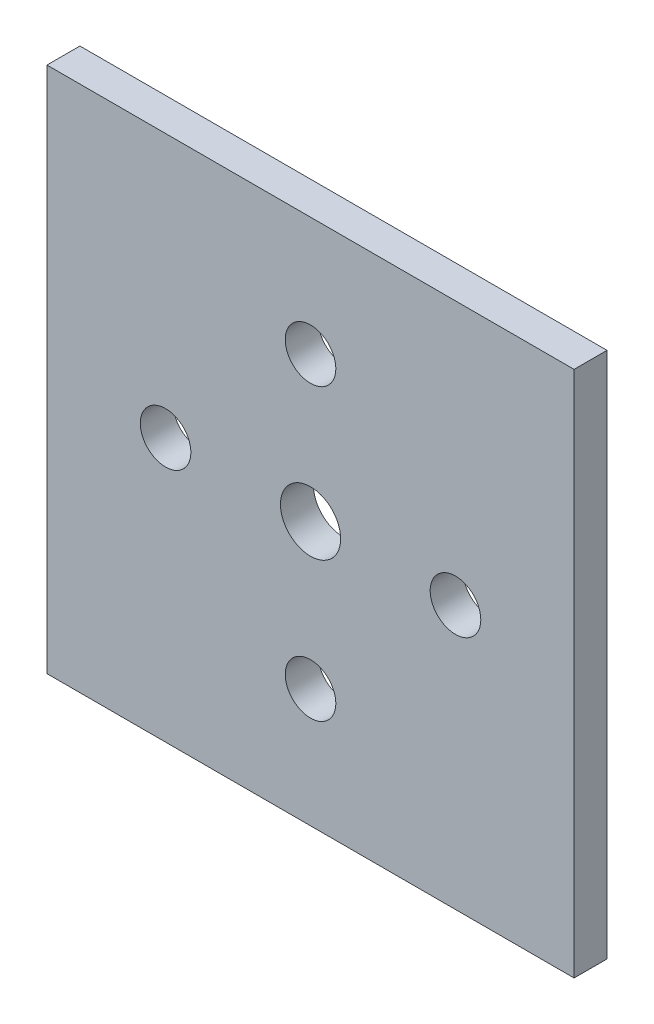
ISO-10303-21;
HEADER;
FILE_DESCRIPTION(('STEP AP214'),'2;1');
FILE_NAME('part.step','',(''),(''),'','','');
FILE_SCHEMA(('AUTOMOTIVE_DESIGN { 1 0 10303 214 1 1 1 1 }'));
ENDSEC;
DATA;
#1=APPLICATION_CONTEXT('core data for automotive mechanical design processes');
#2=APPLICATION_PROTOCOL_DEFINITION('international standard','automotive_design',2000,#1);
#3=PRODUCT_CONTEXT('',#1,'mechanical');
#4=PRODUCT('Part','Part','',(#3));
#5=PRODUCT_RELATED_PRODUCT_CATEGORY('part','',(#4));
#6=PRODUCT_DEFINITION_FORMATION('','',#4);
#7=PRODUCT_DEFINITION_CONTEXT('part definition',#1,'design');
#8=PRODUCT_DEFINITION('design','',#6,#7);
#9=PRODUCT_DEFINITION_SHAPE('','',#8);
#10=(LENGTH_UNIT() NAMED_UNIT(*) SI_UNIT(.MILLI.,.METRE.));
#11=(NAMED_UNIT(*) PLANE_ANGLE_UNIT() SI_UNIT($,.RADIAN.));
#12=(NAMED_UNIT(*) SI_UNIT($,.STERADIAN.) SOLID_ANGLE_UNIT());
#13=UNCERTAINTY_MEASURE_WITH_UNIT(LENGTH_MEASURE(1.E-05),#10,'distance_accuracy_value','');
#14=(GEOMETRIC_REPRESENTATION_CONTEXT(3) GLOBAL_UNCERTAINTY_ASSIGNED_CONTEXT((#13)) GLOBAL_UNIT_ASSIGNED_CONTEXT((#10,
#11,#12)) REPRESENTATION_CONTEXT('',''));
#15=CARTESIAN_POINT('',(0.,0.,0.));
#16=DIRECTION('',(0.,0.,1.));
#17=DIRECTION('',(1.,0.,0.));
#18=AXIS2_PLACEMENT_3D('',#15,#16,#17);
#19=CARTESIAN_POINT('',(0.,0.,-1.5875));
#20=DIRECTION('',(-1.,0.,0.));
#21=DIRECTION('',(0.,0.,1.));
#22=AXIS2_PLACEMENT_3D('',#19,#20,#21);
#23=PLANE('',#22);
#24=DIRECTION('',(0.,-1.,0.));
#25=VECTOR('',#24,1.);
#26=CARTESIAN_POINT('',(0.,0.,0.));
#27=LINE('',#26,#25);
#28=CARTESIAN_POINT('',(0.,25.4,0.));
#29=VERTEX_POINT('',#28);
#30=CARTESIAN_POINT('',(0.,0.,0.));
#31=VERTEX_POINT('',#30);
#32=EDGE_CURVE('E101',#29,#31,#27,.T.);
#33=ORIENTED_EDGE('',*,*,#32,.F.);
#34=DIRECTION('',(0.,0.,1.));
#35=VECTOR('',#34,1.);
#36=CARTESIAN_POINT('',(0.,25.4,-1.5875));
#37=LINE('',#36,#35);
#38=CARTESIAN_POINT('',(0.,25.4,-1.5875));
#39=VERTEX_POINT('',#38);
#40=EDGE_CURVE('E11',#39,#29,#37,.T.);
#41=ORIENTED_EDGE('',*,*,#40,.F.);
#42=DIRECTION('',(0.,-1.,0.));
#43=VECTOR('',#42,1.);
#44=CARTESIAN_POINT('',(0.,0.,-1.5875));
#45=LINE('',#44,#43);
#46=CARTESIAN_POINT('',(0.,0.,-1.5875));
#47=VERTEX_POINT('',#46);
#48=EDGE_CURVE('E94',#39,#47,#45,.T.);
#49=ORIENTED_EDGE('',*,*,#48,.T.);
#50=DIRECTION('',(0.,0.,1.));
#51=VECTOR('',#50,1.);
#52=CARTESIAN_POINT('',(0.,0.,-1.5875));
#53=LINE('',#52,#51);
#54=EDGE_CURVE('E39',#47,#31,#53,.T.);
#55=ORIENTED_EDGE('',*,*,#54,.T.);
#56=EDGE_LOOP('',(#33,#41,#49,#55));
#57=FACE_BOUND('',#56,.T.);
#58=ADVANCED_FACE('F36',(#57),#23,.T.);
#59=CARTESIAN_POINT('',(0.,25.4,-1.5875));
#60=DIRECTION('',(0.,1.,0.));
#61=DIRECTION('',(0.,0.,1.));
#62=AXIS2_PLACEMENT_3D('',#59,#60,#61);
#63=PLANE('',#62);
#64=DIRECTION('',(-1.,0.,0.));
#65=VECTOR('',#64,1.);
#66=CARTESIAN_POINT('',(0.,25.4,0.));
#67=LINE('',#66,#65);
#68=CARTESIAN_POINT('',(25.4,25.4,0.));
#69=VERTEX_POINT('',#68);
#70=EDGE_CURVE('E96',#69,#29,#67,.T.);
#71=ORIENTED_EDGE('',*,*,#70,.F.);
#72=DIRECTION('',(0.,0.,1.));
#73=VECTOR('',#72,1.);
#74=CARTESIAN_POINT('',(25.4,25.4,-1.5875));
#75=LINE('',#74,#73);
#76=CARTESIAN_POINT('',(25.4,25.4,-1.5875));
#77=VERTEX_POINT('',#76);
#78=EDGE_CURVE('E45',#77,#69,#75,.T.);
#79=ORIENTED_EDGE('',*,*,#78,.F.);
#80=DIRECTION('',(-1.,0.,0.));
#81=VECTOR('',#80,1.);
#82=CARTESIAN_POINT('',(0.,25.4,-1.5875));
#83=LINE('',#82,#81);
#84=EDGE_CURVE('E91',#77,#39,#83,.T.);
#85=ORIENTED_EDGE('',*,*,#84,.T.);
#86=ORIENTED_EDGE('',*,*,#40,.T.);
#87=EDGE_LOOP('',(#71,#79,#85,#86));
#88=FACE_BOUND('',#87,.T.);
#89=ADVANCED_FACE('F112',(#88),#63,.T.);
#90=CARTESIAN_POINT('',(25.4,0.,-1.5875));
#91=DIRECTION('',(1.,0.,0.));
#92=DIRECTION('',(0.,0.,-1.));
#93=AXIS2_PLACEMENT_3D('',#90,#91,#92);
#94=PLANE('',#93);
#95=DIRECTION('',(0.,1.,0.));
#96=VECTOR('',#95,1.);
#97=CARTESIAN_POINT('',(25.4,0.,0.));
#98=LINE('',#97,#96);
#99=CARTESIAN_POINT('',(25.4,0.,0.));
#100=VERTEX_POINT('',#99);
#101=EDGE_CURVE('E86',#100,#69,#98,.T.);
#102=ORIENTED_EDGE('',*,*,#101,.F.);
#103=DIRECTION('',(0.,0.,1.));
#104=VECTOR('',#103,1.);
#105=CARTESIAN_POINT('',(25.4,0.,-1.5875));
#106=LINE('',#105,#104);
#107=CARTESIAN_POINT('',(25.4,0.,-1.5875));
#108=VERTEX_POINT('',#107);
#109=EDGE_CURVE('E81',#108,#100,#106,.T.);
#110=ORIENTED_EDGE('',*,*,#109,.F.);
#111=DIRECTION('',(0.,1.,0.));
#112=VECTOR('',#111,1.);
#113=CARTESIAN_POINT('',(25.4,0.,-1.5875));
#114=LINE('',#113,#112);
#115=EDGE_CURVE('E84',#108,#77,#114,.T.);
#116=ORIENTED_EDGE('',*,*,#115,.T.);
#117=ORIENTED_EDGE('',*,*,#78,.T.);
#118=EDGE_LOOP('',(#102,#110,#116,#117));
#119=FACE_BOUND('',#118,.T.);
#120=ADVANCED_FACE('F83',(#119),#94,.T.);
#121=CARTESIAN_POINT('',(0.,0.,-1.5875));
#122=DIRECTION('',(0.,-1.,0.));
#123=DIRECTION('',(0.,0.,-1.));
#124=AXIS2_PLACEMENT_3D('',#121,#122,#123);
#125=PLANE('',#124);
#126=DIRECTION('',(1.,0.,0.));
#127=VECTOR('',#126,1.);
#128=CARTESIAN_POINT('',(0.,0.,0.));
#129=LINE('',#128,#127);
#130=EDGE_CURVE('E104',#31,#100,#129,.T.);
#131=ORIENTED_EDGE('',*,*,#130,.F.);
#132=ORIENTED_EDGE('',*,*,#54,.F.);
#133=DIRECTION('',(1.,0.,0.));
#134=VECTOR('',#133,1.);
#135=CARTESIAN_POINT('',(0.,0.,-1.5875));
#136=LINE('',#135,#134);
#137=EDGE_CURVE('E90',#47,#108,#136,.T.);
#138=ORIENTED_EDGE('',*,*,#137,.T.);
#139=ORIENTED_EDGE('',*,*,#109,.T.);
#140=EDGE_LOOP('',(#131,#132,#138,#139));
#141=FACE_BOUND('',#140,.T.);
#142=ADVANCED_FACE('F93',(#141),#125,.T.);
#143=CARTESIAN_POINT('',(0.,0.,-1.5875));
#144=DIRECTION('',(0.,0.,-1.));
#145=DIRECTION('',(-1.,0.,0.));
#146=AXIS2_PLACEMENT_3D('',#143,#144,#145);
#147=PLANE('',#146);
#148=CARTESIAN_POINT('',(12.7000000000001,5.71499999999999,-1.5875));
#149=DIRECTION('',(0.,0.,1.));
#150=DIRECTION('',(1.,0.,0.));
#151=AXIS2_PLACEMENT_3D('',#148,#149,#150);
#152=CIRCLE('',#151,1.2192);
#153=CARTESIAN_POINT('',(13.9192000000001,5.71499999999999,-1.5875));
#154=VERTEX_POINT('',#153);
#155=EDGE_CURVE('E157',#154,#154,#152,.T.);
#156=ORIENTED_EDGE('',*,*,#155,.T.);
#157=EDGE_LOOP('',(#156));
#158=FACE_BOUND('',#157,.T.);
#159=CARTESIAN_POINT('',(5.715,12.7,-1.5875));
#160=DIRECTION('',(0.,0.,1.));
#161=DIRECTION('',(1.,0.,0.));
#162=AXIS2_PLACEMENT_3D('',#159,#160,#161);
#163=CIRCLE('',#162,1.2192);
#164=CARTESIAN_POINT('',(6.93419999999999,12.7,-1.5875));
#165=VERTEX_POINT('',#164);
#166=EDGE_CURVE('E167',#165,#165,#163,.T.);
#167=ORIENTED_EDGE('',*,*,#166,.T.);
#168=EDGE_LOOP('',(#167));
#169=FACE_BOUND('',#168,.T.);
#170=CARTESIAN_POINT('',(12.7,19.685,-1.5875));
#171=DIRECTION('',(0.,0.,1.));
#172=DIRECTION('',(1.,0.,0.));
#173=AXIS2_PLACEMENT_3D('',#170,#171,#172);
#174=CIRCLE('',#173,1.2192);
#175=CARTESIAN_POINT('',(13.9192,19.685,-1.5875));
#176=VERTEX_POINT('',#175);
#177=EDGE_CURVE('E173',#176,#176,#174,.T.);
#178=ORIENTED_EDGE('',*,*,#177,.T.);
#179=EDGE_LOOP('',(#178));
#180=FACE_BOUND('',#179,.T.);
#181=CARTESIAN_POINT('',(19.685,12.7,-1.5875));
#182=DIRECTION('',(0.,0.,1.));
#183=DIRECTION('',(1.,0.,0.));
#184=AXIS2_PLACEMENT_3D('',#181,#182,#183);
#185=CIRCLE('',#184,1.2192);
#186=CARTESIAN_POINT('',(20.9042,12.7,-1.5875));
#187=VERTEX_POINT('',#186);
#188=EDGE_CURVE('E179',#187,#187,#185,.T.);
#189=ORIENTED_EDGE('',*,*,#188,.T.);
#190=EDGE_LOOP('',(#189));
#191=FACE_BOUND('',#190,.T.);
#192=CARTESIAN_POINT('',(12.7,12.7,-1.5875));
#193=DIRECTION('',(0.,0.,1.));
#194=DIRECTION('',(1.,0.,0.));
#195=AXIS2_PLACEMENT_3D('',#192,#193,#194);
#196=CIRCLE('',#195,1.45);
#197=CARTESIAN_POINT('',(14.15,12.7,-1.5875));
#198=VERTEX_POINT('',#197);
#199=EDGE_CURVE('E105',#198,#198,#196,.T.);
#200=ORIENTED_EDGE('',*,*,#199,.T.);
#201=EDGE_LOOP('',(#200));
#202=FACE_BOUND('',#201,.T.);
#203=ORIENTED_EDGE('',*,*,#48,.F.);
#204=ORIENTED_EDGE('',*,*,#84,.F.);
#205=ORIENTED_EDGE('',*,*,#115,.F.);
#206=ORIENTED_EDGE('',*,*,#137,.F.);
#207=EDGE_LOOP('',(#203,#204,#205,#206));
#208=FACE_BOUND('',#207,.T.);
#209=ADVANCED_FACE('F89',(#158,#169,#180,#191,#202,#208),#147,.T.);
#210=CARTESIAN_POINT('',(0.,0.,0.));
#211=DIRECTION('',(0.,0.,-1.));
#212=DIRECTION('',(-1.,0.,0.));
#213=AXIS2_PLACEMENT_3D('',#210,#211,#212);
#214=PLANE('',#213);
#215=CARTESIAN_POINT('',(12.7000000000001,5.71499999999999,0.));
#216=DIRECTION('',(0.,0.,1.));
#217=DIRECTION('',(1.,0.,0.));
#218=AXIS2_PLACEMENT_3D('',#215,#216,#217);
#219=CIRCLE('',#218,1.2192);
#220=CARTESIAN_POINT('',(13.9192000000001,5.71499999999999,0.));
#221=VERTEX_POINT('',#220);
#222=EDGE_CURVE('E160',#221,#221,#219,.T.);
#223=ORIENTED_EDGE('',*,*,#222,.F.);
#224=EDGE_LOOP('',(#223));
#225=FACE_BOUND('',#224,.T.);
#226=CARTESIAN_POINT('',(5.715,12.7,0.));
#227=DIRECTION('',(0.,0.,1.));
#228=DIRECTION('',(1.,0.,0.));
#229=AXIS2_PLACEMENT_3D('',#226,#227,#228);
#230=CIRCLE('',#229,1.2192);
#231=CARTESIAN_POINT('',(6.93419999999999,12.7,0.));
#232=VERTEX_POINT('',#231);
#233=EDGE_CURVE('E162',#232,#232,#230,.T.);
#234=ORIENTED_EDGE('',*,*,#233,.F.);
#235=EDGE_LOOP('',(#234));
#236=FACE_BOUND('',#235,.T.);
#237=CARTESIAN_POINT('',(12.7,19.685,0.));
#238=DIRECTION('',(0.,0.,1.));
#239=DIRECTION('',(1.,0.,0.));
#240=AXIS2_PLACEMENT_3D('',#237,#238,#239);
#241=CIRCLE('',#240,1.2192);
#242=CARTESIAN_POINT('',(13.9192,19.685,0.));
#243=VERTEX_POINT('',#242);
#244=EDGE_CURVE('E170',#243,#243,#241,.T.);
#245=ORIENTED_EDGE('',*,*,#244,.F.);
#246=EDGE_LOOP('',(#245));
#247=FACE_BOUND('',#246,.T.);
#248=CARTESIAN_POINT('',(19.685,12.7,0.));
#249=DIRECTION('',(0.,0.,1.));
#250=DIRECTION('',(1.,0.,0.));
#251=AXIS2_PLACEMENT_3D('',#248,#249,#250);
#252=CIRCLE('',#251,1.2192);
#253=CARTESIAN_POINT('',(20.9042,12.7,0.));
#254=VERTEX_POINT('',#253);
#255=EDGE_CURVE('E176',#254,#254,#252,.T.);
#256=ORIENTED_EDGE('',*,*,#255,.F.);
#257=EDGE_LOOP('',(#256));
#258=FACE_BOUND('',#257,.T.);
#259=CARTESIAN_POINT('',(12.7,12.7,0.));
#260=DIRECTION('',(0.,0.,1.));
#261=DIRECTION('',(1.,0.,0.));
#262=AXIS2_PLACEMENT_3D('',#259,#260,#261);
#263=CIRCLE('',#262,1.45);
#264=CARTESIAN_POINT('',(14.15,12.7,0.));
#265=VERTEX_POINT('',#264);
#266=EDGE_CURVE('E182',#265,#265,#263,.T.);
#267=ORIENTED_EDGE('',*,*,#266,.F.);
#268=EDGE_LOOP('',(#267));
#269=FACE_BOUND('',#268,.T.);
#270=ORIENTED_EDGE('',*,*,#32,.T.);
#271=ORIENTED_EDGE('',*,*,#130,.T.);
#272=ORIENTED_EDGE('',*,*,#101,.T.);
#273=ORIENTED_EDGE('',*,*,#70,.T.);
#274=EDGE_LOOP('',(#270,#271,#272,#273));
#275=FACE_BOUND('',#274,.T.);
#276=ADVANCED_FACE('F111',(#225,#236,#247,#258,#269,#275),#214,.F.);
#277=CARTESIAN_POINT('',(12.7,12.7,0.));
#278=DIRECTION('',(0.,0.,1.));
#279=DIRECTION('',(1.,0.,0.));
#280=AXIS2_PLACEMENT_3D('',#277,#278,#279);
#281=CYLINDRICAL_SURFACE('',#280,1.45);
#282=ORIENTED_EDGE('',*,*,#199,.F.);
#283=EDGE_LOOP('',(#282));
#284=FACE_BOUND('',#283,.T.);
#285=ORIENTED_EDGE('',*,*,#266,.T.);
#286=EDGE_LOOP('',(#285));
#287=FACE_BOUND('',#286,.T.);
#288=ADVANCED_FACE('F130',(#284,#287),#281,.F.);
#289=CARTESIAN_POINT('',(19.685,12.7,0.));
#290=DIRECTION('',(0.,0.,1.));
#291=DIRECTION('',(1.,0.,0.));
#292=AXIS2_PLACEMENT_3D('',#289,#290,#291);
#293=CYLINDRICAL_SURFACE('',#292,1.2192);
#294=ORIENTED_EDGE('',*,*,#188,.F.);
#295=EDGE_LOOP('',(#294));
#296=FACE_BOUND('',#295,.T.);
#297=ORIENTED_EDGE('',*,*,#255,.T.);
#298=EDGE_LOOP('',(#297));
#299=FACE_BOUND('',#298,.T.);
#300=ADVANCED_FACE('F137',(#296,#299),#293,.F.);
#301=CARTESIAN_POINT('',(12.7,19.685,0.));
#302=DIRECTION('',(0.,0.,1.));
#303=DIRECTION('',(1.,0.,0.));
#304=AXIS2_PLACEMENT_3D('',#301,#302,#303);
#305=CYLINDRICAL_SURFACE('',#304,1.2192);
#306=ORIENTED_EDGE('',*,*,#177,.F.);
#307=EDGE_LOOP('',(#306));
#308=FACE_BOUND('',#307,.T.);
#309=ORIENTED_EDGE('',*,*,#244,.T.);
#310=EDGE_LOOP('',(#309));
#311=FACE_BOUND('',#310,.T.);
#312=ADVANCED_FACE('F141',(#308,#311),#305,.F.);
#313=CARTESIAN_POINT('',(5.715,12.7,0.));
#314=DIRECTION('',(0.,0.,1.));
#315=DIRECTION('',(1.,0.,0.));
#316=AXIS2_PLACEMENT_3D('',#313,#314,#315);
#317=CYLINDRICAL_SURFACE('',#316,1.2192);
#318=ORIENTED_EDGE('',*,*,#166,.F.);
#319=EDGE_LOOP('',(#318));
#320=FACE_BOUND('',#319,.T.);
#321=ORIENTED_EDGE('',*,*,#233,.T.);
#322=EDGE_LOOP('',(#321));
#323=FACE_BOUND('',#322,.T.);
#324=ADVANCED_FACE('F145',(#320,#323),#317,.F.);
#325=CARTESIAN_POINT('',(12.7000000000001,5.71499999999999,0.));
#326=DIRECTION('',(0.,0.,1.));
#327=DIRECTION('',(1.,0.,0.));
#328=AXIS2_PLACEMENT_3D('',#325,#326,#327);
#329=CYLINDRICAL_SURFACE('',#328,1.2192);
#330=ORIENTED_EDGE('',*,*,#155,.F.);
#331=EDGE_LOOP('',(#330));
#332=FACE_BOUND('',#331,.T.);
#333=ORIENTED_EDGE('',*,*,#222,.T.);
#334=EDGE_LOOP('',(#333));
#335=FACE_BOUND('',#334,.T.);
#336=ADVANCED_FACE('F149',(#332,#335),#329,.F.);
#337=CLOSED_SHELL('',(#58,#89,#120,#142,#209,#276,#288,#300,#312,#324,#336));
#338=MANIFOLD_SOLID_BREP('B2',#337);
#339=ADVANCED_BREP_SHAPE_REPRESENTATION('',(#18,#338),#14);
#340=SHAPE_DEFINITION_REPRESENTATION(#9,#339);
ENDSEC;
END-ISO-10303-21;
